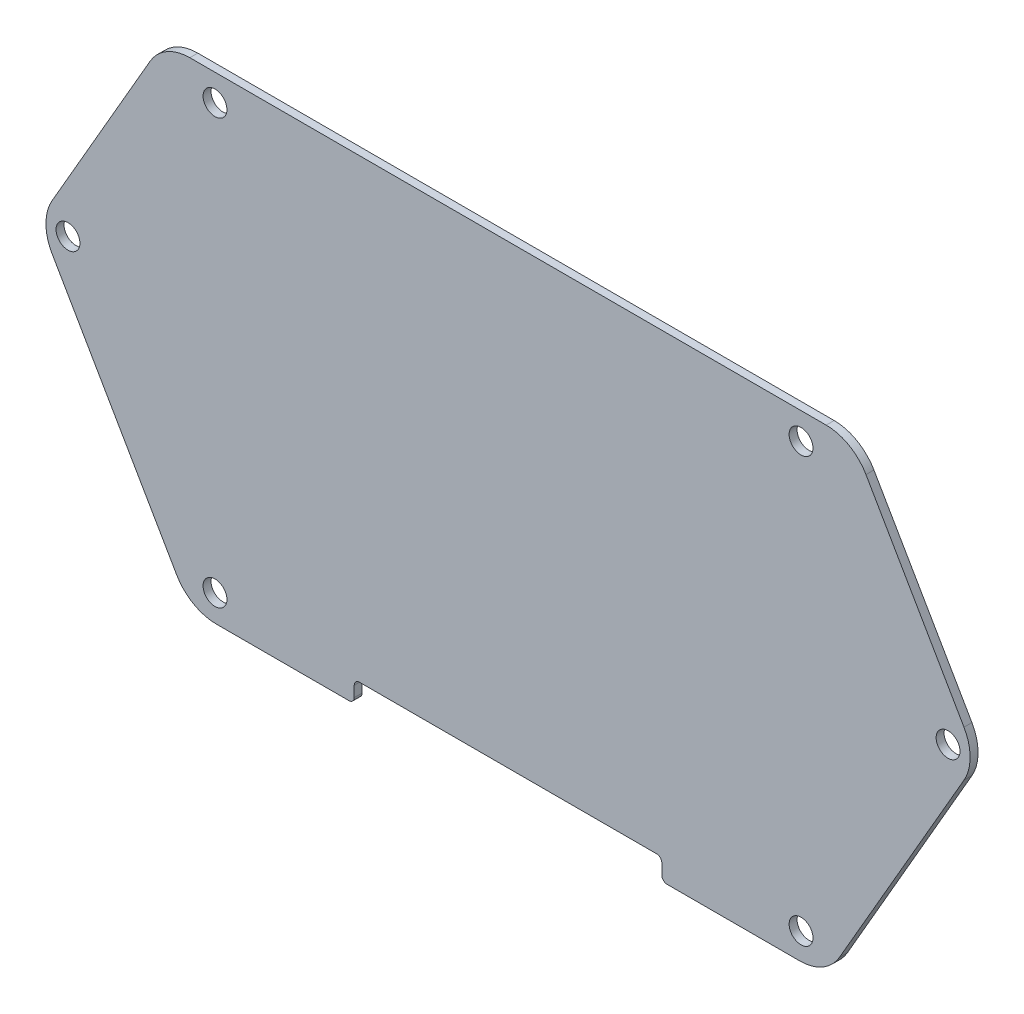
ISO-10303-21;
HEADER;
FILE_DESCRIPTION(('STEP AP214'),'2;1');
FILE_NAME('part.step','',(''),(''),'','','');
FILE_SCHEMA(('AUTOMOTIVE_DESIGN { 1 0 10303 214 1 1 1 1 }'));
ENDSEC;
DATA;
#1=APPLICATION_CONTEXT('core data for automotive mechanical design processes');
#2=APPLICATION_PROTOCOL_DEFINITION('international standard','automotive_design',2000,#1);
#3=PRODUCT_CONTEXT('',#1,'mechanical');
#4=PRODUCT('Part','Part','',(#3));
#5=PRODUCT_RELATED_PRODUCT_CATEGORY('part','',(#4));
#6=PRODUCT_DEFINITION_FORMATION('','',#4);
#7=PRODUCT_DEFINITION_CONTEXT('part definition',#1,'design');
#8=PRODUCT_DEFINITION('design','',#6,#7);
#9=PRODUCT_DEFINITION_SHAPE('','',#8);
#10=(LENGTH_UNIT() NAMED_UNIT(*) SI_UNIT(.MILLI.,.METRE.));
#11=(NAMED_UNIT(*) PLANE_ANGLE_UNIT() SI_UNIT($,.RADIAN.));
#12=(NAMED_UNIT(*) SI_UNIT($,.STERADIAN.) SOLID_ANGLE_UNIT());
#13=UNCERTAINTY_MEASURE_WITH_UNIT(LENGTH_MEASURE(1.E-05),#10,'distance_accuracy_value','');
#14=(GEOMETRIC_REPRESENTATION_CONTEXT(3) GLOBAL_UNCERTAINTY_ASSIGNED_CONTEXT((#13)) GLOBAL_UNIT_ASSIGNED_CONTEXT((#10,
#11,#12)) REPRESENTATION_CONTEXT('',''));
#15=CARTESIAN_POINT('',(0.,0.,0.));
#16=DIRECTION('',(0.,0.,1.));
#17=DIRECTION('',(1.,0.,0.));
#18=AXIS2_PLACEMENT_3D('',#15,#16,#17);
#19=CARTESIAN_POINT('',(59.9999999999999,-49.3301270189222,-1.5));
#20=DIRECTION('',(0.,-1.,0.));
#21=DIRECTION('',(1.,0.,0.));
#22=AXIS2_PLACEMENT_3D('',#19,#20,#21);
#23=PLANE('',#22);
#24=DIRECTION('',(1.,0.,0.));
#25=VECTOR('',#24,1.);
#26=CARTESIAN_POINT('',(59.9999999999999,-49.3301270189222,0.));
#27=LINE('',#26,#25);
#28=CARTESIAN_POINT('',(30.,-49.3301270189222,0.));
#29=VERTEX_POINT('',#28);
#30=CARTESIAN_POINT('',(55.0000000000001,-49.3301270189222,0.));
#31=VERTEX_POINT('',#30);
#32=EDGE_CURVE('E218',#29,#31,#27,.T.);
#33=ORIENTED_EDGE('',*,*,#32,.F.);
#34=DIRECTION('',(0.,0.,1.));
#35=VECTOR('',#34,1.);
#36=CARTESIAN_POINT('',(30.,-49.3301270189222,-10.));
#37=LINE('',#36,#35);
#38=CARTESIAN_POINT('',(30.,-49.3301270189222,-1.5));
#39=VERTEX_POINT('',#38);
#40=EDGE_CURVE('E70',#39,#29,#37,.T.);
#41=ORIENTED_EDGE('',*,*,#40,.F.);
#42=DIRECTION('',(1.,0.,0.));
#43=VECTOR('',#42,1.);
#44=CARTESIAN_POINT('',(59.9999999999999,-49.3301270189222,-1.5));
#45=LINE('',#44,#43);
#46=CARTESIAN_POINT('',(55.0000000000001,-49.3301270189222,-1.5));
#47=VERTEX_POINT('',#46);
#48=EDGE_CURVE('E62',#39,#47,#45,.T.);
#49=ORIENTED_EDGE('',*,*,#48,.T.);
#50=DIRECTION('',(0.,0.,1.));
#51=VECTOR('',#50,1.);
#52=CARTESIAN_POINT('',(55.0000000000001,-49.3301270189222,-10.));
#53=LINE('',#52,#51);
#54=EDGE_CURVE('E320',#47,#31,#53,.T.);
#55=ORIENTED_EDGE('',*,*,#54,.T.);
#56=EDGE_LOOP('',(#33,#41,#49,#55));
#57=FACE_BOUND('',#56,.T.);
#58=ADVANCED_FACE('F53',(#57),#23,.T.);
#59=DIRECTION('',(0.,0.,1.));
#60=VECTOR('',#59,1.);
#61=CARTESIAN_POINT('',(-30.,-49.3301270189222,-10.));
#62=LINE('',#61,#60);
#63=CARTESIAN_POINT('',(-30.,-49.3301270189222,-1.5));
#64=VERTEX_POINT('',#63);
#65=CARTESIAN_POINT('',(-30.,-49.3301270189222,0.));
#66=VERTEX_POINT('',#65);
#67=EDGE_CURVE('E195',#64,#66,#62,.T.);
#68=ORIENTED_EDGE('',*,*,#67,.T.);
#69=CARTESIAN_POINT('',(-55.0000000000001,-49.3301270189222,0.));
#70=VERTEX_POINT('',#69);
#71=EDGE_CURVE('E209',#70,#66,#27,.T.);
#72=ORIENTED_EDGE('',*,*,#71,.F.);
#73=DIRECTION('',(0.,0.,1.));
#74=VECTOR('',#73,1.);
#75=CARTESIAN_POINT('',(-55.0000000000001,-49.3301270189222,-10.));
#76=LINE('',#75,#74);
#77=CARTESIAN_POINT('',(-55.0000000000001,-49.3301270189222,-1.5));
#78=VERTEX_POINT('',#77);
#79=EDGE_CURVE('E275',#78,#70,#76,.T.);
#80=ORIENTED_EDGE('',*,*,#79,.F.);
#81=EDGE_CURVE('E13',#78,#64,#45,.T.);
#82=ORIENTED_EDGE('',*,*,#81,.T.);
#83=EDGE_LOOP('',(#68,#72,#80,#82));
#84=FACE_BOUND('',#83,.T.);
#85=ADVANCED_FACE('F207',(#84),#23,.T.);
#86=CARTESIAN_POINT('',(88.4807621135331,0.,-1.5));
#87=DIRECTION('',(0.866025403784438,-0.500000000000001,0.));
#88=DIRECTION('',(0.500000000000001,0.866025403784438,0.));
#89=AXIS2_PLACEMENT_3D('',#86,#87,#88);
#90=PLANE('',#89);
#91=DIRECTION('',(0.,0.,1.));
#92=VECTOR('',#91,1.);
#93=CARTESIAN_POINT('',(62.4999999999999,-45.0000000000002,-10.));
#94=LINE('',#93,#92);
#95=CARTESIAN_POINT('',(62.4999999999999,-45.0000000000002,-1.5));
#96=VERTEX_POINT('',#95);
#97=CARTESIAN_POINT('',(62.4999999999998,-45.0000000000001,0.));
#98=VERTEX_POINT('',#97);
#99=EDGE_CURVE('E331',#96,#98,#94,.T.);
#100=ORIENTED_EDGE('',*,*,#99,.F.);
#101=DIRECTION('',(0.500000000000001,0.866025403784438,0.));
#102=VECTOR('',#101,1.);
#103=CARTESIAN_POINT('',(88.4807621135331,0.,-1.5));
#104=LINE('',#103,#102);
#105=CARTESIAN_POINT('',(85.9807621135331,-4.33012701892226,-1.5));
#106=VERTEX_POINT('',#105);
#107=EDGE_CURVE('E217',#96,#106,#104,.T.);
#108=ORIENTED_EDGE('',*,*,#107,.T.);
#109=DIRECTION('',(0.,0.,1.));
#110=VECTOR('',#109,1.);
#111=CARTESIAN_POINT('',(85.9807621135331,-4.33012701892226,-10.));
#112=LINE('',#111,#110);
#113=CARTESIAN_POINT('',(85.9807621135331,-4.33012701892226,0.));
#114=VERTEX_POINT('',#113);
#115=EDGE_CURVE('E413',#106,#114,#112,.T.);
#116=ORIENTED_EDGE('',*,*,#115,.T.);
#117=DIRECTION('',(0.500000000000001,0.866025403784438,0.));
#118=VECTOR('',#117,1.);
#119=CARTESIAN_POINT('',(88.4807621135331,0.,0.));
#120=LINE('',#119,#118);
#121=EDGE_CURVE('E244',#98,#114,#120,.T.);
#122=ORIENTED_EDGE('',*,*,#121,.F.);
#123=EDGE_LOOP('',(#100,#108,#116,#122));
#124=FACE_BOUND('',#123,.T.);
#125=ADVANCED_FACE('F55',(#124),#90,.T.);
#126=CARTESIAN_POINT('',(65.0000000000001,40.6698729810778,-1.5));
#127=DIRECTION('',(0.86602540378444,0.499999999999997,0.));
#128=DIRECTION('',(-0.499999999999997,0.86602540378444,0.));
#129=AXIS2_PLACEMENT_3D('',#126,#127,#128);
#130=PLANE('',#129);
#131=DIRECTION('',(-0.499999999999997,0.86602540378444,0.));
#132=VECTOR('',#131,1.);
#133=CARTESIAN_POINT('',(65.0000000000001,40.6698729810778,-1.5));
#134=LINE('',#133,#132);
#135=CARTESIAN_POINT('',(85.9807621135331,4.33012701892207,-1.5));
#136=VERTEX_POINT('',#135);
#137=CARTESIAN_POINT('',(67.4999999999998,36.3397459621556,-1.5));
#138=VERTEX_POINT('',#137);
#139=EDGE_CURVE('E221',#136,#138,#134,.T.);
#140=ORIENTED_EDGE('',*,*,#139,.T.);
#141=DIRECTION('',(0.,0.,1.));
#142=VECTOR('',#141,1.);
#143=CARTESIAN_POINT('',(67.4999999999998,36.3397459621556,-10.));
#144=LINE('',#143,#142);
#145=CARTESIAN_POINT('',(67.4999999999998,36.3397459621556,0.));
#146=VERTEX_POINT('',#145);
#147=EDGE_CURVE('E400',#138,#146,#144,.T.);
#148=ORIENTED_EDGE('',*,*,#147,.T.);
#149=DIRECTION('',(-0.499999999999997,0.86602540378444,0.));
#150=VECTOR('',#149,1.);
#151=CARTESIAN_POINT('',(65.0000000000001,40.6698729810778,0.));
#152=LINE('',#151,#150);
#153=CARTESIAN_POINT('',(85.9807621135332,4.33012701892211,0.));
#154=VERTEX_POINT('',#153);
#155=EDGE_CURVE('E248',#154,#146,#152,.T.);
#156=ORIENTED_EDGE('',*,*,#155,.F.);
#157=DIRECTION('',(0.,0.,1.));
#158=VECTOR('',#157,1.);
#159=CARTESIAN_POINT('',(85.9807621135331,4.33012701892207,-10.));
#160=LINE('',#159,#158);
#161=EDGE_CURVE('E78',#136,#154,#160,.T.);
#162=ORIENTED_EDGE('',*,*,#161,.F.);
#163=EDGE_LOOP('',(#140,#148,#156,#162));
#164=FACE_BOUND('',#163,.T.);
#165=ADVANCED_FACE('F389',(#164),#130,.T.);
#166=CARTESIAN_POINT('',(0.,0.,-1.5));
#167=DIRECTION('',(0.,0.,-1.));
#168=DIRECTION('',(-1.,0.,0.));
#169=AXIS2_PLACEMENT_3D('',#166,#167,#168);
#170=PLANE('',#169);
#171=CARTESIAN_POINT('',(-30.,-48.3301270189222,-1.5));
#172=DIRECTION('',(0.,0.,-1.));
#173=DIRECTION('',(-1.,0.,0.));
#174=AXIS2_PLACEMENT_3D('',#171,#172,#173);
#175=CIRCLE('',#174,0.999999999999997);
#176=CARTESIAN_POINT('',(-29.,-48.3301270189222,-1.5));
#177=VERTEX_POINT('',#176);
#178=EDGE_CURVE('E418',#64,#177,#175,.F.);
#179=ORIENTED_EDGE('',*,*,#178,.F.);
#180=ORIENTED_EDGE('',*,*,#81,.F.);
#181=CARTESIAN_POINT('',(-55.0000000000001,-40.6698729810781,-1.5));
#182=DIRECTION('',(0.,0.,-1.));
#183=DIRECTION('',(-1.,0.,0.));
#184=AXIS2_PLACEMENT_3D('',#181,#182,#183);
#185=CIRCLE('',#184,8.66025403784408);
#186=CARTESIAN_POINT('',(-62.4999999999999,-45.0000000000002,-1.5));
#187=VERTEX_POINT('',#186);
#188=EDGE_CURVE('E285',#187,#78,#185,.F.);
#189=ORIENTED_EDGE('',*,*,#188,.F.);
#190=DIRECTION('',(0.499999999999998,-0.86602540378444,0.));
#191=VECTOR('',#190,1.);
#192=CARTESIAN_POINT('',(-60.0000000000001,-49.3301270189222,-1.5));
#193=LINE('',#192,#191);
#194=CARTESIAN_POINT('',(-85.9807621135331,-4.33012701892226,-1.5));
#195=VERTEX_POINT('',#194);
#196=EDGE_CURVE('E272',#195,#187,#193,.T.);
#197=ORIENTED_EDGE('',*,*,#196,.F.);
#198=CARTESIAN_POINT('',(-78.4807621135331,0.,-1.5));
#199=DIRECTION('',(0.,0.,-1.));
#200=DIRECTION('',(-1.,0.,0.));
#201=AXIS2_PLACEMENT_3D('',#198,#199,#200);
#202=CIRCLE('',#201,8.66025403784433);
#203=CARTESIAN_POINT('',(-85.9807621135331,4.33012701892207,-1.5));
#204=VERTEX_POINT('',#203);
#205=EDGE_CURVE('E287',#204,#195,#202,.F.);
#206=ORIENTED_EDGE('',*,*,#205,.F.);
#207=DIRECTION('',(-0.500000000000001,-0.866025403784438,0.));
#208=VECTOR('',#207,1.);
#209=CARTESIAN_POINT('',(-88.4807621135331,0.,-1.5));
#210=LINE('',#209,#208);
#211=CARTESIAN_POINT('',(-67.4999999999998,36.3397459621556,-1.5));
#212=VERTEX_POINT('',#211);
#213=EDGE_CURVE('E313',#212,#204,#210,.T.);
#214=ORIENTED_EDGE('',*,*,#213,.F.);
#215=CARTESIAN_POINT('',(-59.9999999999999,32.0096189432335,-1.5));
#216=DIRECTION('',(0.,0.,-1.));
#217=DIRECTION('',(-1.,0.,0.));
#218=AXIS2_PLACEMENT_3D('',#215,#216,#217);
#219=CIRCLE('',#218,8.66025403784434);
#220=CARTESIAN_POINT('',(-59.9999999999999,40.6698729810778,-1.5));
#221=VERTEX_POINT('',#220);
#222=EDGE_CURVE('E290',#221,#212,#219,.F.);
#223=ORIENTED_EDGE('',*,*,#222,.F.);
#224=DIRECTION('',(-1.,0.,0.));
#225=VECTOR('',#224,1.);
#226=CARTESIAN_POINT('',(-64.9999999999999,40.6698729810778,-1.5));
#227=LINE('',#226,#225);
#228=CARTESIAN_POINT('',(59.9999999999999,40.6698729810778,-1.5));
#229=VERTEX_POINT('',#228);
#230=EDGE_CURVE('E311',#229,#221,#227,.T.);
#231=ORIENTED_EDGE('',*,*,#230,.F.);
#232=CARTESIAN_POINT('',(59.9999999999999,32.0096189432335,-1.5));
#233=DIRECTION('',(0.,0.,-1.));
#234=DIRECTION('',(-1.,0.,0.));
#235=AXIS2_PLACEMENT_3D('',#232,#233,#234);
#236=CIRCLE('',#235,8.66025403784434);
#237=EDGE_CURVE('E337',#229,#138,#236,.T.);
#238=ORIENTED_EDGE('',*,*,#237,.T.);
#239=ORIENTED_EDGE('',*,*,#139,.F.);
#240=CARTESIAN_POINT('',(78.4807621135331,0.,-1.5));
#241=DIRECTION('',(0.,0.,-1.));
#242=DIRECTION('',(-1.,0.,0.));
#243=AXIS2_PLACEMENT_3D('',#240,#241,#242);
#244=CIRCLE('',#243,8.66025403784433);
#245=EDGE_CURVE('E338',#136,#106,#244,.T.);
#246=ORIENTED_EDGE('',*,*,#245,.T.);
#247=ORIENTED_EDGE('',*,*,#107,.F.);
#248=CARTESIAN_POINT('',(55.0000000000001,-40.6698729810781,-1.5));
#249=DIRECTION('',(0.,0.,-1.));
#250=DIRECTION('',(-1.,0.,0.));
#251=AXIS2_PLACEMENT_3D('',#248,#249,#250);
#252=CIRCLE('',#251,8.66025403784408);
#253=EDGE_CURVE('E327',#96,#47,#252,.T.);
#254=ORIENTED_EDGE('',*,*,#253,.T.);
#255=ORIENTED_EDGE('',*,*,#48,.F.);
#256=CARTESIAN_POINT('',(30.,-48.3301270189222,-1.5));
#257=DIRECTION('',(0.,0.,-1.));
#258=DIRECTION('',(-1.,0.,0.));
#259=AXIS2_PLACEMENT_3D('',#256,#257,#258);
#260=CIRCLE('',#259,0.999999999999997);
#261=CARTESIAN_POINT('',(29.,-48.3301270189222,-1.5));
#262=VERTEX_POINT('',#261);
#263=EDGE_CURVE('E432',#262,#39,#260,.F.);
#264=ORIENTED_EDGE('',*,*,#263,.F.);
#265=DIRECTION('',(0.,-1.,0.));
#266=VECTOR('',#265,1.);
#267=CARTESIAN_POINT('',(28.9999999999999,0.,-1.5));
#268=LINE('',#267,#266);
#269=CARTESIAN_POINT('',(29.,-46.3301270189222,-1.5));
#270=VERTEX_POINT('',#269);
#271=EDGE_CURVE('E430',#270,#262,#268,.T.);
#272=ORIENTED_EDGE('',*,*,#271,.F.);
#273=CARTESIAN_POINT('',(28.,-46.3301270189222,-1.5));
#274=DIRECTION('',(0.,0.,-1.));
#275=DIRECTION('',(-1.,0.,0.));
#276=AXIS2_PLACEMENT_3D('',#273,#274,#275);
#277=CIRCLE('',#276,1.00000000000001);
#278=CARTESIAN_POINT('',(28.,-45.3301270189222,-1.5));
#279=VERTEX_POINT('',#278);
#280=EDGE_CURVE('E428',#279,#270,#277,.T.);
#281=ORIENTED_EDGE('',*,*,#280,.F.);
#282=DIRECTION('',(1.,0.,0.));
#283=VECTOR('',#282,1.);
#284=CARTESIAN_POINT('',(0.,-45.3301270189222,-1.5));
#285=LINE('',#284,#283);
#286=CARTESIAN_POINT('',(-28.,-45.3301270189222,-1.5));
#287=VERTEX_POINT('',#286);
#288=EDGE_CURVE('E426',#287,#279,#285,.T.);
#289=ORIENTED_EDGE('',*,*,#288,.F.);
#290=CARTESIAN_POINT('',(-28.,-46.3301270189222,-1.5));
#291=DIRECTION('',(0.,0.,-1.));
#292=DIRECTION('',(-1.,0.,0.));
#293=AXIS2_PLACEMENT_3D('',#290,#291,#292);
#294=CIRCLE('',#293,1.00000000000001);
#295=CARTESIAN_POINT('',(-29.,-46.3301270189222,-1.5));
#296=VERTEX_POINT('',#295);
#297=EDGE_CURVE('E424',#296,#287,#294,.T.);
#298=ORIENTED_EDGE('',*,*,#297,.F.);
#299=DIRECTION('',(0.,1.,0.));
#300=VECTOR('',#299,1.);
#301=CARTESIAN_POINT('',(-28.9999999999999,0.,-1.5));
#302=LINE('',#301,#300);
#303=EDGE_CURVE('E422',#177,#296,#302,.T.);
#304=ORIENTED_EDGE('',*,*,#303,.F.);
#305=EDGE_LOOP('',(#179,#180,#189,#197,#206,#214,#223,#231,#238,#239,#246,#247,#254,#255,#264,
#272,#281,#289,#298,#304));
#306=FACE_BOUND('',#305,.T.);
#307=CARTESIAN_POINT('',(82.9807621135331,0.,-1.5));
#308=DIRECTION('',(0.,0.,-1.));
#309=DIRECTION('',(-1.,0.,0.));
#310=AXIS2_PLACEMENT_3D('',#307,#308,#309);
#311=CIRCLE('',#310,2.25);
#312=CARTESIAN_POINT('',(80.7307621135331,0.,-1.5));
#313=VERTEX_POINT('',#312);
#314=EDGE_CURVE('E231',#313,#313,#311,.T.);
#315=ORIENTED_EDGE('',*,*,#314,.F.);
#316=EDGE_LOOP('',(#315));
#317=FACE_BOUND('',#316,.T.);
#318=CARTESIAN_POINT('',(55.2577379452377,35.6698729810778,-1.5));
#319=DIRECTION('',(0.,0.,-1.));
#320=DIRECTION('',(-1.,0.,0.));
#321=AXIS2_PLACEMENT_3D('',#318,#319,#320);
#322=CIRCLE('',#321,2.25);
#323=CARTESIAN_POINT('',(53.0077379452377,35.6698729810778,-1.5));
#324=VERTEX_POINT('',#323);
#325=EDGE_CURVE('E292',#324,#324,#322,.T.);
#326=ORIENTED_EDGE('',*,*,#325,.F.);
#327=EDGE_LOOP('',(#326));
#328=FACE_BOUND('',#327,.T.);
#329=CARTESIAN_POINT('',(-55.2577379452377,35.6698729810778,-1.5));
#330=DIRECTION('',(0.,0.,-1.));
#331=DIRECTION('',(-1.,0.,0.));
#332=AXIS2_PLACEMENT_3D('',#329,#330,#331);
#333=CIRCLE('',#332,2.25);
#334=CARTESIAN_POINT('',(-57.5077379452377,35.6698729810778,-1.5));
#335=VERTEX_POINT('',#334);
#336=EDGE_CURVE('E298',#335,#335,#333,.T.);
#337=ORIENTED_EDGE('',*,*,#336,.F.);
#338=EDGE_LOOP('',(#337));
#339=FACE_BOUND('',#338,.T.);
#340=CARTESIAN_POINT('',(-82.9807621135334,0.,-1.5));
#341=DIRECTION('',(0.,0.,-1.));
#342=DIRECTION('',(-1.,0.,0.));
#343=AXIS2_PLACEMENT_3D('',#340,#341,#342);
#344=CIRCLE('',#343,2.24999999999998);
#345=CARTESIAN_POINT('',(-85.2307621135333,0.,-1.5));
#346=VERTEX_POINT('',#345);
#347=EDGE_CURVE('E304',#346,#346,#344,.T.);
#348=ORIENTED_EDGE('',*,*,#347,.F.);
#349=EDGE_LOOP('',(#348));
#350=FACE_BOUND('',#349,.T.);
#351=CARTESIAN_POINT('',(-55.2577379452378,-44.3301270189221,-1.5));
#352=DIRECTION('',(0.,0.,-1.));
#353=DIRECTION('',(-1.,0.,0.));
#354=AXIS2_PLACEMENT_3D('',#351,#352,#353);
#355=CIRCLE('',#354,2.25);
#356=CARTESIAN_POINT('',(-57.5077379452378,-44.3301270189221,-1.5));
#357=VERTEX_POINT('',#356);
#358=EDGE_CURVE('E301',#357,#357,#355,.T.);
#359=ORIENTED_EDGE('',*,*,#358,.F.);
#360=EDGE_LOOP('',(#359));
#361=FACE_BOUND('',#360,.T.);
#362=CARTESIAN_POINT('',(55.2577379452377,-44.3301270189221,-1.5));
#363=DIRECTION('',(0.,0.,-1.));
#364=DIRECTION('',(-1.,0.,0.));
#365=AXIS2_PLACEMENT_3D('',#362,#363,#364);
#366=CIRCLE('',#365,2.25);
#367=CARTESIAN_POINT('',(53.0077379452377,-44.3301270189221,-1.5));
#368=VERTEX_POINT('',#367);
#369=EDGE_CURVE('E295',#368,#368,#366,.T.);
#370=ORIENTED_EDGE('',*,*,#369,.F.);
#371=EDGE_LOOP('',(#370));
#372=FACE_BOUND('',#371,.T.);
#373=ADVANCED_FACE('F334',(#306,#317,#328,#339,#350,#361,#372),#170,.T.);
#374=CARTESIAN_POINT('',(0.,0.,0.));
#375=DIRECTION('',(0.,0.,-1.));
#376=DIRECTION('',(-1.,0.,0.));
#377=AXIS2_PLACEMENT_3D('',#374,#375,#376);
#378=PLANE('',#377);
#379=CARTESIAN_POINT('',(55.2577379452377,-44.3301270189221,0.));
#380=DIRECTION('',(0.,0.,-1.));
#381=DIRECTION('',(-1.,0.,0.));
#382=AXIS2_PLACEMENT_3D('',#379,#380,#381);
#383=CIRCLE('',#382,2.25);
#384=CARTESIAN_POINT('',(53.0077379452377,-44.3301270189221,0.));
#385=VERTEX_POINT('',#384);
#386=EDGE_CURVE('E227',#385,#385,#383,.T.);
#387=ORIENTED_EDGE('',*,*,#386,.T.);
#388=EDGE_LOOP('',(#387));
#389=FACE_BOUND('',#388,.T.);
#390=CARTESIAN_POINT('',(-55.2577379452378,-44.3301270189221,0.));
#391=DIRECTION('',(0.,0.,-1.));
#392=DIRECTION('',(-1.,0.,0.));
#393=AXIS2_PLACEMENT_3D('',#390,#391,#392);
#394=CIRCLE('',#393,2.25);
#395=CARTESIAN_POINT('',(-57.5077379452378,-44.3301270189221,0.));
#396=VERTEX_POINT('',#395);
#397=EDGE_CURVE('E230',#396,#396,#394,.T.);
#398=ORIENTED_EDGE('',*,*,#397,.T.);
#399=EDGE_LOOP('',(#398));
#400=FACE_BOUND('',#399,.T.);
#401=CARTESIAN_POINT('',(-82.9807621135334,0.,0.));
#402=DIRECTION('',(0.,0.,-1.));
#403=DIRECTION('',(-1.,0.,0.));
#404=AXIS2_PLACEMENT_3D('',#401,#402,#403);
#405=CIRCLE('',#404,2.24999999999998);
#406=CARTESIAN_POINT('',(-85.2307621135333,0.,0.));
#407=VERTEX_POINT('',#406);
#408=EDGE_CURVE('E234',#407,#407,#405,.T.);
#409=ORIENTED_EDGE('',*,*,#408,.T.);
#410=EDGE_LOOP('',(#409));
#411=FACE_BOUND('',#410,.T.);
#412=CARTESIAN_POINT('',(-55.2577379452377,35.6698729810778,0.));
#413=DIRECTION('',(0.,0.,-1.));
#414=DIRECTION('',(-1.,0.,0.));
#415=AXIS2_PLACEMENT_3D('',#412,#413,#414);
#416=CIRCLE('',#415,2.25);
#417=CARTESIAN_POINT('',(-57.5077379452377,35.6698729810778,0.));
#418=VERTEX_POINT('',#417);
#419=EDGE_CURVE('E237',#418,#418,#416,.T.);
#420=ORIENTED_EDGE('',*,*,#419,.T.);
#421=EDGE_LOOP('',(#420));
#422=FACE_BOUND('',#421,.T.);
#423=CARTESIAN_POINT('',(55.2577379452377,35.6698729810778,0.));
#424=DIRECTION('',(0.,0.,-1.));
#425=DIRECTION('',(-1.,0.,0.));
#426=AXIS2_PLACEMENT_3D('',#423,#424,#425);
#427=CIRCLE('',#426,2.25);
#428=CARTESIAN_POINT('',(53.0077379452377,35.6698729810778,0.));
#429=VERTEX_POINT('',#428);
#430=EDGE_CURVE('E239',#429,#429,#427,.T.);
#431=ORIENTED_EDGE('',*,*,#430,.T.);
#432=EDGE_LOOP('',(#431));
#433=FACE_BOUND('',#432,.T.);
#434=CARTESIAN_POINT('',(82.9807621135331,0.,0.));
#435=DIRECTION('',(0.,0.,-1.));
#436=DIRECTION('',(-1.,0.,0.));
#437=AXIS2_PLACEMENT_3D('',#434,#435,#436);
#438=CIRCLE('',#437,2.25);
#439=CARTESIAN_POINT('',(80.7307621135331,0.,0.));
#440=VERTEX_POINT('',#439);
#441=EDGE_CURVE('E57',#440,#440,#438,.T.);
#442=ORIENTED_EDGE('',*,*,#441,.T.);
#443=EDGE_LOOP('',(#442));
#444=FACE_BOUND('',#443,.T.);
#445=ORIENTED_EDGE('',*,*,#71,.T.);
#446=CARTESIAN_POINT('',(-30.,-48.3301270189222,0.));
#447=DIRECTION('',(0.,0.,-1.));
#448=DIRECTION('',(1.,0.,0.));
#449=AXIS2_PLACEMENT_3D('',#446,#447,#448);
#450=CIRCLE('',#449,0.999999999999997);
#451=CARTESIAN_POINT('',(-29.,-48.3301270189222,0.));
#452=VERTEX_POINT('',#451);
#453=EDGE_CURVE('E192',#452,#66,#450,.T.);
#454=ORIENTED_EDGE('',*,*,#453,.F.);
#455=DIRECTION('',(0.,-1.,0.));
#456=VECTOR('',#455,1.);
#457=CARTESIAN_POINT('',(-29.,-48.3301270189222,0.));
#458=LINE('',#457,#456);
#459=CARTESIAN_POINT('',(-29.,-46.3301270189222,0.));
#460=VERTEX_POINT('',#459);
#461=EDGE_CURVE('E211',#460,#452,#458,.T.);
#462=ORIENTED_EDGE('',*,*,#461,.F.);
#463=CARTESIAN_POINT('',(-28.,-46.3301270189222,0.));
#464=DIRECTION('',(0.,0.,1.));
#465=DIRECTION('',(-1.,0.,0.));
#466=AXIS2_PLACEMENT_3D('',#463,#464,#465);
#467=CIRCLE('',#466,1.00000000000001);
#468=CARTESIAN_POINT('',(-28.,-45.3301270189222,0.));
#469=VERTEX_POINT('',#468);
#470=EDGE_CURVE('E447',#469,#460,#467,.T.);
#471=ORIENTED_EDGE('',*,*,#470,.F.);
#472=DIRECTION('',(-1.,0.,0.));
#473=VECTOR('',#472,1.);
#474=CARTESIAN_POINT('',(-28.,-45.3301270189222,0.));
#475=LINE('',#474,#473);
#476=CARTESIAN_POINT('',(28.,-45.3301270189222,0.));
#477=VERTEX_POINT('',#476);
#478=EDGE_CURVE('E450',#477,#469,#475,.T.);
#479=ORIENTED_EDGE('',*,*,#478,.F.);
#480=CARTESIAN_POINT('',(28.,-46.3301270189222,0.));
#481=DIRECTION('',(0.,0.,1.));
#482=DIRECTION('',(1.,0.,0.));
#483=AXIS2_PLACEMENT_3D('',#480,#481,#482);
#484=CIRCLE('',#483,1.00000000000001);
#485=CARTESIAN_POINT('',(29.,-46.3301270189222,0.));
#486=VERTEX_POINT('',#485);
#487=EDGE_CURVE('E453',#486,#477,#484,.T.);
#488=ORIENTED_EDGE('',*,*,#487,.F.);
#489=DIRECTION('',(0.,1.,0.));
#490=VECTOR('',#489,1.);
#491=CARTESIAN_POINT('',(29.,-48.3301270189222,0.));
#492=LINE('',#491,#490);
#493=CARTESIAN_POINT('',(29.,-48.3301270189222,0.));
#494=VERTEX_POINT('',#493);
#495=EDGE_CURVE('E456',#494,#486,#492,.T.);
#496=ORIENTED_EDGE('',*,*,#495,.F.);
#497=CARTESIAN_POINT('',(30.,-48.3301270189222,0.));
#498=DIRECTION('',(0.,0.,-1.));
#499=DIRECTION('',(-1.,0.,0.));
#500=AXIS2_PLACEMENT_3D('',#497,#498,#499);
#501=CIRCLE('',#500,0.999999999999997);
#502=EDGE_CURVE('E203',#29,#494,#501,.T.);
#503=ORIENTED_EDGE('',*,*,#502,.F.);
#504=ORIENTED_EDGE('',*,*,#32,.T.);
#505=CARTESIAN_POINT('',(55.0000000000001,-40.6698729810781,0.));
#506=DIRECTION('',(0.,0.,1.));
#507=DIRECTION('',(-1.,0.,0.));
#508=AXIS2_PLACEMENT_3D('',#505,#506,#507);
#509=CIRCLE('',#508,8.66025403784408);
#510=EDGE_CURVE('E329',#31,#98,#509,.T.);
#511=ORIENTED_EDGE('',*,*,#510,.T.);
#512=ORIENTED_EDGE('',*,*,#121,.T.);
#513=CARTESIAN_POINT('',(78.4807621135331,0.,0.));
#514=DIRECTION('',(0.,0.,1.));
#515=DIRECTION('',(1.,0.,0.));
#516=AXIS2_PLACEMENT_3D('',#513,#514,#515);
#517=CIRCLE('',#516,8.66025403784433);
#518=EDGE_CURVE('E416',#114,#154,#517,.T.);
#519=ORIENTED_EDGE('',*,*,#518,.T.);
#520=ORIENTED_EDGE('',*,*,#155,.T.);
#521=CARTESIAN_POINT('',(59.9999999999999,32.0096189432335,0.));
#522=DIRECTION('',(0.,0.,1.));
#523=DIRECTION('',(1.,0.,0.));
#524=AXIS2_PLACEMENT_3D('',#521,#522,#523);
#525=CIRCLE('',#524,8.66025403784434);
#526=CARTESIAN_POINT('',(59.9999999999999,40.6698729810778,0.));
#527=VERTEX_POINT('',#526);
#528=EDGE_CURVE('E417',#146,#527,#525,.T.);
#529=ORIENTED_EDGE('',*,*,#528,.T.);
#530=DIRECTION('',(-1.,0.,0.));
#531=VECTOR('',#530,1.);
#532=CARTESIAN_POINT('',(-64.9999999999999,40.6698729810778,0.));
#533=LINE('',#532,#531);
#534=CARTESIAN_POINT('',(-59.9999999999999,40.6698729810778,0.));
#535=VERTEX_POINT('',#534);
#536=EDGE_CURVE('E253',#527,#535,#533,.T.);
#537=ORIENTED_EDGE('',*,*,#536,.T.);
#538=CARTESIAN_POINT('',(-59.9999999999999,32.0096189432335,0.));
#539=DIRECTION('',(0.,0.,-1.));
#540=DIRECTION('',(-1.,0.,0.));
#541=AXIS2_PLACEMENT_3D('',#538,#539,#540);
#542=CIRCLE('',#541,8.66025403784434);
#543=CARTESIAN_POINT('',(-67.4999999999999,36.3397459621557,0.));
#544=VERTEX_POINT('',#543);
#545=EDGE_CURVE('E341',#544,#535,#542,.T.);
#546=ORIENTED_EDGE('',*,*,#545,.F.);
#547=DIRECTION('',(-0.500000000000001,-0.866025403784438,0.));
#548=VECTOR('',#547,1.);
#549=CARTESIAN_POINT('',(-88.4807621135331,0.,0.));
#550=LINE('',#549,#548);
#551=CARTESIAN_POINT('',(-85.9807621135331,4.33012701892207,0.));
#552=VERTEX_POINT('',#551);
#553=EDGE_CURVE('E257',#544,#552,#550,.T.);
#554=ORIENTED_EDGE('',*,*,#553,.T.);
#555=CARTESIAN_POINT('',(-78.4807621135331,0.,0.));
#556=DIRECTION('',(0.,0.,-1.));
#557=DIRECTION('',(-1.,0.,0.));
#558=AXIS2_PLACEMENT_3D('',#555,#556,#557);
#559=CIRCLE('',#558,8.66025403784433);
#560=CARTESIAN_POINT('',(-85.9807621135331,-4.33012701892227,0.));
#561=VERTEX_POINT('',#560);
#562=EDGE_CURVE('E263',#561,#552,#559,.T.);
#563=ORIENTED_EDGE('',*,*,#562,.F.);
#564=DIRECTION('',(0.499999999999998,-0.86602540378444,0.));
#565=VECTOR('',#564,1.);
#566=CARTESIAN_POINT('',(-60.0000000000001,-49.3301270189222,0.));
#567=LINE('',#566,#565);
#568=CARTESIAN_POINT('',(-62.4999999999999,-45.0000000000002,0.));
#569=VERTEX_POINT('',#568);
#570=EDGE_CURVE('E223',#561,#569,#567,.T.);
#571=ORIENTED_EDGE('',*,*,#570,.T.);
#572=CARTESIAN_POINT('',(-55.0000000000001,-40.6698729810781,0.));
#573=DIRECTION('',(0.,0.,-1.));
#574=DIRECTION('',(1.,0.,0.));
#575=AXIS2_PLACEMENT_3D('',#572,#573,#574);
#576=CIRCLE('',#575,8.66025403784408);
#577=EDGE_CURVE('E216',#70,#569,#576,.T.);
#578=ORIENTED_EDGE('',*,*,#577,.F.);
#579=EDGE_LOOP('',(#445,#454,#462,#471,#479,#488,#496,#503,#504,#511,#512,#519,#520,#529,#537,
#546,#554,#563,#571,#578));
#580=FACE_BOUND('',#579,.T.);
#581=ADVANCED_FACE('F214',(#389,#400,#411,#422,#433,#444,#580),#378,.F.);
#582=CARTESIAN_POINT('',(-60.0000000000001,-49.3301270189222,-1.5));
#583=DIRECTION('',(-0.86602540378444,-0.499999999999998,0.));
#584=DIRECTION('',(0.499999999999998,-0.86602540378444,0.));
#585=AXIS2_PLACEMENT_3D('',#582,#583,#584);
#586=PLANE('',#585);
#587=ORIENTED_EDGE('',*,*,#570,.F.);
#588=DIRECTION('',(0.,0.,1.));
#589=VECTOR('',#588,1.);
#590=CARTESIAN_POINT('',(-85.9807621135331,-4.33012701892226,-10.));
#591=LINE('',#590,#589);
#592=EDGE_CURVE('E269',#195,#561,#591,.T.);
#593=ORIENTED_EDGE('',*,*,#592,.F.);
#594=ORIENTED_EDGE('',*,*,#196,.T.);
#595=DIRECTION('',(0.,0.,1.));
#596=VECTOR('',#595,1.);
#597=CARTESIAN_POINT('',(-62.4999999999999,-45.0000000000002,-10.));
#598=LINE('',#597,#596);
#599=EDGE_CURVE('E271',#187,#569,#598,.T.);
#600=ORIENTED_EDGE('',*,*,#599,.T.);
#601=EDGE_LOOP('',(#587,#593,#594,#600));
#602=FACE_BOUND('',#601,.T.);
#603=ADVANCED_FACE('F267',(#602),#586,.T.);
#604=CARTESIAN_POINT('',(-88.4807621135331,0.,-1.5));
#605=DIRECTION('',(-0.866025403784438,0.500000000000001,0.));
#606=DIRECTION('',(-0.500000000000001,-0.866025403784438,0.));
#607=AXIS2_PLACEMENT_3D('',#604,#605,#606);
#608=PLANE('',#607);
#609=ORIENTED_EDGE('',*,*,#553,.F.);
#610=DIRECTION('',(0.,0.,1.));
#611=VECTOR('',#610,1.);
#612=CARTESIAN_POINT('',(-67.4999999999998,36.3397459621556,-10.));
#613=LINE('',#612,#611);
#614=EDGE_CURVE('E288',#212,#544,#613,.T.);
#615=ORIENTED_EDGE('',*,*,#614,.F.);
#616=ORIENTED_EDGE('',*,*,#213,.T.);
#617=DIRECTION('',(0.,0.,1.));
#618=VECTOR('',#617,1.);
#619=CARTESIAN_POINT('',(-85.9807621135331,4.33012701892207,-10.));
#620=LINE('',#619,#618);
#621=EDGE_CURVE('E277',#204,#552,#620,.T.);
#622=ORIENTED_EDGE('',*,*,#621,.T.);
#623=EDGE_LOOP('',(#609,#615,#616,#622));
#624=FACE_BOUND('',#623,.T.);
#625=ADVANCED_FACE('F352',(#624),#608,.T.);
#626=CARTESIAN_POINT('',(-64.9999999999999,40.6698729810778,-1.5));
#627=DIRECTION('',(0.,1.,0.));
#628=DIRECTION('',(-1.,0.,0.));
#629=AXIS2_PLACEMENT_3D('',#626,#627,#628);
#630=PLANE('',#629);
#631=DIRECTION('',(0.,0.,1.));
#632=VECTOR('',#631,1.);
#633=CARTESIAN_POINT('',(59.9999999999999,40.6698729810778,-10.));
#634=LINE('',#633,#632);
#635=EDGE_CURVE('E330',#229,#527,#634,.T.);
#636=ORIENTED_EDGE('',*,*,#635,.F.);
#637=ORIENTED_EDGE('',*,*,#230,.T.);
#638=DIRECTION('',(0.,0.,1.));
#639=VECTOR('',#638,1.);
#640=CARTESIAN_POINT('',(-59.9999999999999,40.6698729810778,-10.));
#641=LINE('',#640,#639);
#642=EDGE_CURVE('E279',#221,#535,#641,.T.);
#643=ORIENTED_EDGE('',*,*,#642,.T.);
#644=ORIENTED_EDGE('',*,*,#536,.F.);
#645=EDGE_LOOP('',(#636,#637,#643,#644));
#646=FACE_BOUND('',#645,.T.);
#647=ADVANCED_FACE('F385',(#646),#630,.T.);
#648=CARTESIAN_POINT('',(55.2577379452377,-44.3301270189221,8.5));
#649=DIRECTION('',(0.,0.,-1.));
#650=DIRECTION('',(-1.,0.,0.));
#651=AXIS2_PLACEMENT_3D('',#648,#649,#650);
#652=CYLINDRICAL_SURFACE('',#651,2.25);
#653=ORIENTED_EDGE('',*,*,#369,.T.);
#654=EDGE_LOOP('',(#653));
#655=FACE_BOUND('',#654,.T.);
#656=ORIENTED_EDGE('',*,*,#386,.F.);
#657=EDGE_LOOP('',(#656));
#658=FACE_BOUND('',#657,.T.);
#659=ADVANCED_FACE('F387',(#655,#658),#652,.F.);
#660=CARTESIAN_POINT('',(-55.2577379452378,-44.3301270189221,8.5));
#661=DIRECTION('',(0.,0.,-1.));
#662=DIRECTION('',(-1.,0.,0.));
#663=AXIS2_PLACEMENT_3D('',#660,#661,#662);
#664=CYLINDRICAL_SURFACE('',#663,2.25);
#665=ORIENTED_EDGE('',*,*,#358,.T.);
#666=EDGE_LOOP('',(#665));
#667=FACE_BOUND('',#666,.T.);
#668=ORIENTED_EDGE('',*,*,#397,.F.);
#669=EDGE_LOOP('',(#668));
#670=FACE_BOUND('',#669,.T.);
#671=ADVANCED_FACE('F688',(#667,#670),#664,.F.);
#672=CARTESIAN_POINT('',(-82.9807621135334,0.,8.5));
#673=DIRECTION('',(0.,0.,-1.));
#674=DIRECTION('',(-1.,0.,0.));
#675=AXIS2_PLACEMENT_3D('',#672,#673,#674);
#676=CYLINDRICAL_SURFACE('',#675,2.24999999999998);
#677=ORIENTED_EDGE('',*,*,#347,.T.);
#678=EDGE_LOOP('',(#677));
#679=FACE_BOUND('',#678,.T.);
#680=ORIENTED_EDGE('',*,*,#408,.F.);
#681=EDGE_LOOP('',(#680));
#682=FACE_BOUND('',#681,.T.);
#683=ADVANCED_FACE('F678',(#679,#682),#676,.F.);
#684=CARTESIAN_POINT('',(-55.2577379452377,35.6698729810778,8.5));
#685=DIRECTION('',(0.,0.,-1.));
#686=DIRECTION('',(-1.,0.,0.));
#687=AXIS2_PLACEMENT_3D('',#684,#685,#686);
#688=CYLINDRICAL_SURFACE('',#687,2.25);
#689=ORIENTED_EDGE('',*,*,#336,.T.);
#690=EDGE_LOOP('',(#689));
#691=FACE_BOUND('',#690,.T.);
#692=ORIENTED_EDGE('',*,*,#419,.F.);
#693=EDGE_LOOP('',(#692));
#694=FACE_BOUND('',#693,.T.);
#695=ADVANCED_FACE('F668',(#691,#694),#688,.F.);
#696=CARTESIAN_POINT('',(55.2577379452377,35.6698729810778,8.5));
#697=DIRECTION('',(0.,0.,-1.));
#698=DIRECTION('',(-1.,0.,0.));
#699=AXIS2_PLACEMENT_3D('',#696,#697,#698);
#700=CYLINDRICAL_SURFACE('',#699,2.25);
#701=ORIENTED_EDGE('',*,*,#325,.T.);
#702=EDGE_LOOP('',(#701));
#703=FACE_BOUND('',#702,.T.);
#704=ORIENTED_EDGE('',*,*,#430,.F.);
#705=EDGE_LOOP('',(#704));
#706=FACE_BOUND('',#705,.T.);
#707=ADVANCED_FACE('F369',(#703,#706),#700,.F.);
#708=CARTESIAN_POINT('',(82.9807621135331,0.,8.5));
#709=DIRECTION('',(0.,0.,-1.));
#710=DIRECTION('',(-1.,0.,0.));
#711=AXIS2_PLACEMENT_3D('',#708,#709,#710);
#712=CYLINDRICAL_SURFACE('',#711,2.25);
#713=ORIENTED_EDGE('',*,*,#314,.T.);
#714=EDGE_LOOP('',(#713));
#715=FACE_BOUND('',#714,.T.);
#716=ORIENTED_EDGE('',*,*,#441,.F.);
#717=EDGE_LOOP('',(#716));
#718=FACE_BOUND('',#717,.T.);
#719=ADVANCED_FACE('F361',(#715,#718),#712,.F.);
#720=CARTESIAN_POINT('',(-55.0000000000001,-40.6698729810781,-10.));
#721=DIRECTION('',(0.,0.,1.));
#722=DIRECTION('',(1.,0.,0.));
#723=AXIS2_PLACEMENT_3D('',#720,#721,#722);
#724=CYLINDRICAL_SURFACE('',#723,8.66025403784408);
#725=ORIENTED_EDGE('',*,*,#188,.T.);
#726=ORIENTED_EDGE('',*,*,#79,.T.);
#727=ORIENTED_EDGE('',*,*,#577,.T.);
#728=ORIENTED_EDGE('',*,*,#599,.F.);
#729=EDGE_LOOP('',(#725,#726,#727,#728));
#730=FACE_BOUND('',#729,.T.);
#731=ADVANCED_FACE('F359',(#730),#724,.T.);
#732=CARTESIAN_POINT('',(-78.4807621135331,0.,-10.));
#733=DIRECTION('',(0.,0.,1.));
#734=DIRECTION('',(1.,0.,0.));
#735=AXIS2_PLACEMENT_3D('',#732,#733,#734);
#736=CYLINDRICAL_SURFACE('',#735,8.66025403784433);
#737=ORIENTED_EDGE('',*,*,#205,.T.);
#738=ORIENTED_EDGE('',*,*,#592,.T.);
#739=ORIENTED_EDGE('',*,*,#562,.T.);
#740=ORIENTED_EDGE('',*,*,#621,.F.);
#741=EDGE_LOOP('',(#737,#738,#739,#740));
#742=FACE_BOUND('',#741,.T.);
#743=ADVANCED_FACE('F357',(#742),#736,.T.);
#744=CARTESIAN_POINT('',(-59.9999999999999,32.0096189432335,-10.));
#745=DIRECTION('',(0.,0.,1.));
#746=DIRECTION('',(1.,0.,0.));
#747=AXIS2_PLACEMENT_3D('',#744,#745,#746);
#748=CYLINDRICAL_SURFACE('',#747,8.66025403784434);
#749=ORIENTED_EDGE('',*,*,#222,.T.);
#750=ORIENTED_EDGE('',*,*,#614,.T.);
#751=ORIENTED_EDGE('',*,*,#545,.T.);
#752=ORIENTED_EDGE('',*,*,#642,.F.);
#753=EDGE_LOOP('',(#749,#750,#751,#752));
#754=FACE_BOUND('',#753,.T.);
#755=ADVANCED_FACE('F367',(#754),#748,.T.);
#756=CARTESIAN_POINT('',(78.4807621135331,0.,-10.));
#757=DIRECTION('',(0.,0.,1.));
#758=DIRECTION('',(1.,0.,0.));
#759=AXIS2_PLACEMENT_3D('',#756,#757,#758);
#760=CYLINDRICAL_SURFACE('',#759,8.66025403784433);
#761=ORIENTED_EDGE('',*,*,#161,.T.);
#762=ORIENTED_EDGE('',*,*,#518,.F.);
#763=ORIENTED_EDGE('',*,*,#115,.F.);
#764=ORIENTED_EDGE('',*,*,#245,.F.);
#765=EDGE_LOOP('',(#761,#762,#763,#764));
#766=FACE_BOUND('',#765,.T.);
#767=ADVANCED_FACE('F503',(#766),#760,.T.);
#768=CARTESIAN_POINT('',(55.0000000000001,-40.6698729810781,-10.));
#769=DIRECTION('',(0.,0.,1.));
#770=DIRECTION('',(1.,0.,0.));
#771=AXIS2_PLACEMENT_3D('',#768,#769,#770);
#772=CYLINDRICAL_SURFACE('',#771,8.66025403784408);
#773=ORIENTED_EDGE('',*,*,#99,.T.);
#774=ORIENTED_EDGE('',*,*,#510,.F.);
#775=ORIENTED_EDGE('',*,*,#54,.F.);
#776=ORIENTED_EDGE('',*,*,#253,.F.);
#777=EDGE_LOOP('',(#773,#774,#775,#776));
#778=FACE_BOUND('',#777,.T.);
#779=ADVANCED_FACE('F326',(#778),#772,.T.);
#780=CARTESIAN_POINT('',(59.9999999999999,32.0096189432335,-10.));
#781=DIRECTION('',(0.,0.,1.));
#782=DIRECTION('',(1.,0.,0.));
#783=AXIS2_PLACEMENT_3D('',#780,#781,#782);
#784=CYLINDRICAL_SURFACE('',#783,8.66025403784434);
#785=ORIENTED_EDGE('',*,*,#635,.T.);
#786=ORIENTED_EDGE('',*,*,#528,.F.);
#787=ORIENTED_EDGE('',*,*,#147,.F.);
#788=ORIENTED_EDGE('',*,*,#237,.F.);
#789=EDGE_LOOP('',(#785,#786,#787,#788));
#790=FACE_BOUND('',#789,.T.);
#791=ADVANCED_FACE('F404',(#790),#784,.T.);
#792=CARTESIAN_POINT('',(-30.,-48.3301270189222,-10.));
#793=DIRECTION('',(0.,0.,1.));
#794=DIRECTION('',(1.,0.,0.));
#795=AXIS2_PLACEMENT_3D('',#792,#793,#794);
#796=CYLINDRICAL_SURFACE('',#795,0.999999999999997);
#797=ORIENTED_EDGE('',*,*,#178,.T.);
#798=DIRECTION('',(0.,0.,1.));
#799=VECTOR('',#798,1.);
#800=CARTESIAN_POINT('',(-29.,-48.3301270189222,-10.));
#801=LINE('',#800,#799);
#802=EDGE_CURVE('E198',#177,#452,#801,.T.);
#803=ORIENTED_EDGE('',*,*,#802,.T.);
#804=ORIENTED_EDGE('',*,*,#453,.T.);
#805=ORIENTED_EDGE('',*,*,#67,.F.);
#806=EDGE_LOOP('',(#797,#803,#804,#805));
#807=FACE_BOUND('',#806,.T.);
#808=ADVANCED_FACE('F194',(#807),#796,.T.);
#809=CARTESIAN_POINT('',(-29.,-48.3301270189222,-10.));
#810=DIRECTION('',(-1.,0.,0.));
#811=DIRECTION('',(0.,-1.,0.));
#812=AXIS2_PLACEMENT_3D('',#809,#810,#811);
#813=PLANE('',#812);
#814=ORIENTED_EDGE('',*,*,#303,.T.);
#815=DIRECTION('',(0.,0.,1.));
#816=VECTOR('',#815,1.);
#817=CARTESIAN_POINT('',(-29.,-46.3301270189222,-10.));
#818=LINE('',#817,#816);
#819=EDGE_CURVE('E443',#296,#460,#818,.T.);
#820=ORIENTED_EDGE('',*,*,#819,.T.);
#821=ORIENTED_EDGE('',*,*,#461,.T.);
#822=ORIENTED_EDGE('',*,*,#802,.F.);
#823=EDGE_LOOP('',(#814,#820,#821,#822));
#824=FACE_BOUND('',#823,.T.);
#825=ADVANCED_FACE('F483',(#824),#813,.F.);
#826=CARTESIAN_POINT('',(-28.,-46.3301270189222,-10.));
#827=DIRECTION('',(0.,0.,1.));
#828=DIRECTION('',(1.,0.,0.));
#829=AXIS2_PLACEMENT_3D('',#826,#827,#828);
#830=CYLINDRICAL_SURFACE('',#829,1.00000000000001);
#831=ORIENTED_EDGE('',*,*,#297,.T.);
#832=DIRECTION('',(0.,0.,1.));
#833=VECTOR('',#832,1.);
#834=CARTESIAN_POINT('',(-28.,-45.3301270189222,-10.));
#835=LINE('',#834,#833);
#836=EDGE_CURVE('E441',#287,#469,#835,.T.);
#837=ORIENTED_EDGE('',*,*,#836,.T.);
#838=ORIENTED_EDGE('',*,*,#470,.T.);
#839=ORIENTED_EDGE('',*,*,#819,.F.);
#840=EDGE_LOOP('',(#831,#837,#838,#839));
#841=FACE_BOUND('',#840,.T.);
#842=ADVANCED_FACE('F479',(#841),#830,.F.);
#843=CARTESIAN_POINT('',(-28.,-45.3301270189222,-10.));
#844=DIRECTION('',(0.,1.,0.));
#845=DIRECTION('',(-1.,0.,0.));
#846=AXIS2_PLACEMENT_3D('',#843,#844,#845);
#847=PLANE('',#846);
#848=ORIENTED_EDGE('',*,*,#288,.T.);
#849=DIRECTION('',(0.,0.,1.));
#850=VECTOR('',#849,1.);
#851=CARTESIAN_POINT('',(28.,-45.3301270189222,-10.));
#852=LINE('',#851,#850);
#853=EDGE_CURVE('E439',#279,#477,#852,.T.);
#854=ORIENTED_EDGE('',*,*,#853,.T.);
#855=ORIENTED_EDGE('',*,*,#478,.T.);
#856=ORIENTED_EDGE('',*,*,#836,.F.);
#857=EDGE_LOOP('',(#848,#854,#855,#856));
#858=FACE_BOUND('',#857,.T.);
#859=ADVANCED_FACE('F475',(#858),#847,.F.);
#860=CARTESIAN_POINT('',(28.,-46.3301270189222,-10.));
#861=DIRECTION('',(0.,0.,1.));
#862=DIRECTION('',(1.,0.,0.));
#863=AXIS2_PLACEMENT_3D('',#860,#861,#862);
#864=CYLINDRICAL_SURFACE('',#863,1.00000000000001);
#865=ORIENTED_EDGE('',*,*,#280,.T.);
#866=DIRECTION('',(0.,0.,1.));
#867=VECTOR('',#866,1.);
#868=CARTESIAN_POINT('',(29.,-46.3301270189222,-10.));
#869=LINE('',#868,#867);
#870=EDGE_CURVE('E437',#270,#486,#869,.T.);
#871=ORIENTED_EDGE('',*,*,#870,.T.);
#872=ORIENTED_EDGE('',*,*,#487,.T.);
#873=ORIENTED_EDGE('',*,*,#853,.F.);
#874=EDGE_LOOP('',(#865,#871,#872,#873));
#875=FACE_BOUND('',#874,.T.);
#876=ADVANCED_FACE('F473',(#875),#864,.F.);
#877=CARTESIAN_POINT('',(29.,-48.3301270189222,-10.));
#878=DIRECTION('',(1.,0.,0.));
#879=DIRECTION('',(0.,1.,0.));
#880=AXIS2_PLACEMENT_3D('',#877,#878,#879);
#881=PLANE('',#880);
#882=ORIENTED_EDGE('',*,*,#271,.T.);
#883=DIRECTION('',(0.,0.,1.));
#884=VECTOR('',#883,1.);
#885=CARTESIAN_POINT('',(29.,-48.3301270189222,-10.));
#886=LINE('',#885,#884);
#887=EDGE_CURVE('E435',#262,#494,#886,.T.);
#888=ORIENTED_EDGE('',*,*,#887,.T.);
#889=ORIENTED_EDGE('',*,*,#495,.T.);
#890=ORIENTED_EDGE('',*,*,#870,.F.);
#891=EDGE_LOOP('',(#882,#888,#889,#890));
#892=FACE_BOUND('',#891,.T.);
#893=ADVANCED_FACE('F466',(#892),#881,.F.);
#894=CARTESIAN_POINT('',(30.,-48.3301270189222,-10.));
#895=DIRECTION('',(0.,0.,1.));
#896=DIRECTION('',(1.,0.,0.));
#897=AXIS2_PLACEMENT_3D('',#894,#895,#896);
#898=CYLINDRICAL_SURFACE('',#897,0.999999999999997);
#899=ORIENTED_EDGE('',*,*,#263,.T.);
#900=ORIENTED_EDGE('',*,*,#40,.T.);
#901=ORIENTED_EDGE('',*,*,#502,.T.);
#902=ORIENTED_EDGE('',*,*,#887,.F.);
#903=EDGE_LOOP('',(#899,#900,#901,#902));
#904=FACE_BOUND('',#903,.T.);
#905=ADVANCED_FACE('F461',(#904),#898,.T.);
#906=CLOSED_SHELL('',(#58,#85,#125,#165,#373,#581,#603,#625,#647,#659,#671,#683,#695,#707,#719,
#731,#743,#755,#767,#779,#791,#808,#825,#842,#859,#876,#893,#905));
#907=MANIFOLD_SOLID_BREP('B2',#906);
#908=ADVANCED_BREP_SHAPE_REPRESENTATION('',(#18,#907),#14);
#909=SHAPE_DEFINITION_REPRESENTATION(#9,#908);
ENDSEC;
END-ISO-10303-21;
